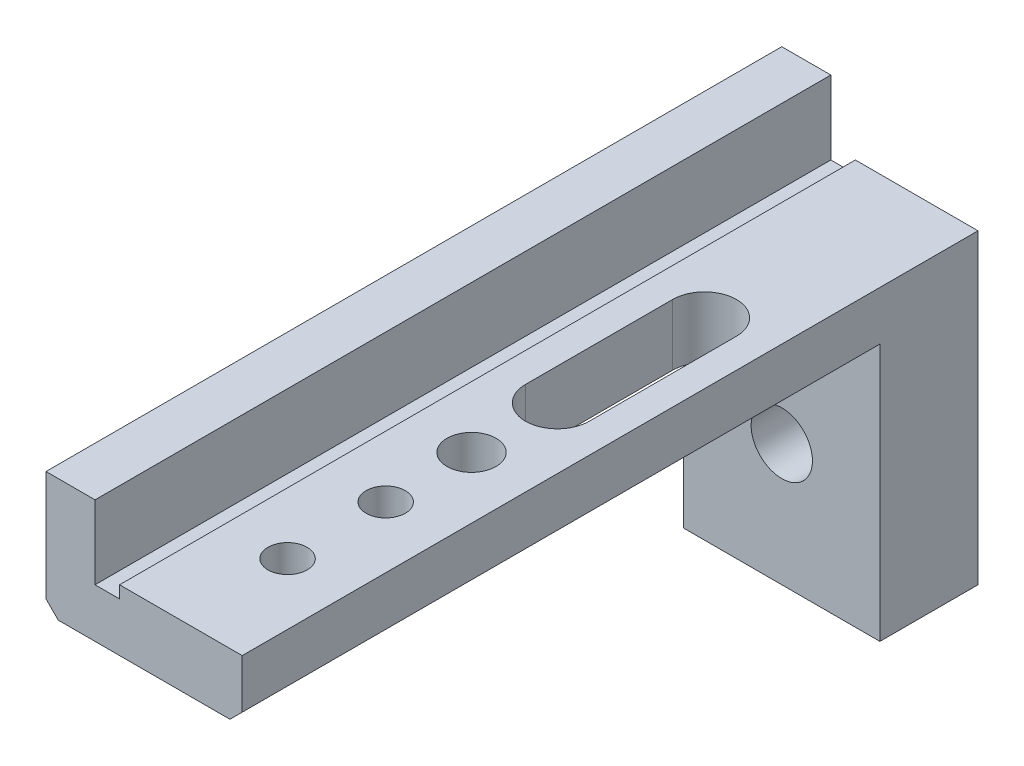
ISO-10303-21;
HEADER;
FILE_DESCRIPTION(('STEP AP214'),'2;1');
FILE_NAME('part.step','',(''),(''),'','','');
FILE_SCHEMA(('AUTOMOTIVE_DESIGN { 1 0 10303 214 1 1 1 1 }'));
ENDSEC;
DATA;
#1=APPLICATION_CONTEXT('core data for automotive mechanical design processes');
#2=APPLICATION_PROTOCOL_DEFINITION('international standard','automotive_design',2000,#1);
#3=PRODUCT_CONTEXT('',#1,'mechanical');
#4=PRODUCT('Part','Part','',(#3));
#5=PRODUCT_RELATED_PRODUCT_CATEGORY('part','',(#4));
#6=PRODUCT_DEFINITION_FORMATION('','',#4);
#7=PRODUCT_DEFINITION_CONTEXT('part definition',#1,'design');
#8=PRODUCT_DEFINITION('design','',#6,#7);
#9=PRODUCT_DEFINITION_SHAPE('','',#8);
#10=(LENGTH_UNIT() NAMED_UNIT(*) SI_UNIT(.MILLI.,.METRE.));
#11=(NAMED_UNIT(*) PLANE_ANGLE_UNIT() SI_UNIT($,.RADIAN.));
#12=(NAMED_UNIT(*) SI_UNIT($,.STERADIAN.) SOLID_ANGLE_UNIT());
#13=UNCERTAINTY_MEASURE_WITH_UNIT(LENGTH_MEASURE(1.E-05),#10,'distance_accuracy_value','');
#14=(GEOMETRIC_REPRESENTATION_CONTEXT(3) GLOBAL_UNCERTAINTY_ASSIGNED_CONTEXT((#13)) GLOBAL_UNIT_ASSIGNED_CONTEXT((#10,
#11,#12)) REPRESENTATION_CONTEXT('',''));
#15=CARTESIAN_POINT('',(0.,0.,0.));
#16=DIRECTION('',(0.,0.,1.));
#17=DIRECTION('',(1.,0.,0.));
#18=AXIS2_PLACEMENT_3D('',#15,#16,#17);
#19=CARTESIAN_POINT('',(-5.15254237288136,-1.99999999999999,30.));
#20=DIRECTION('',(0.,1.,0.));
#21=DIRECTION('',(0.,0.,1.));
#22=AXIS2_PLACEMENT_3D('',#19,#20,#21);
#23=PLANE('',#22);
#24=CARTESIAN_POINT('',(0.347457627118638,-1.99999999999999,21.65));
#25=DIRECTION('',(0.,1.,0.));
#26=DIRECTION('',(0.,0.,1.));
#27=AXIS2_PLACEMENT_3D('',#24,#25,#26);
#28=CIRCLE('',#27,0.799999999999997);
#29=CARTESIAN_POINT('',(0.347457627118638,-1.99999999999999,22.45));
#30=VERTEX_POINT('',#29);
#31=EDGE_CURVE('E402',#30,#30,#28,.T.);
#32=ORIENTED_EDGE('',*,*,#31,.T.);
#33=EDGE_LOOP('',(#32));
#34=FACE_BOUND('',#33,.T.);
#35=CARTESIAN_POINT('',(0.347457627118638,-1.99999999999999,25.65));
#36=DIRECTION('',(0.,1.,0.));
#37=DIRECTION('',(0.,0.,1.));
#38=AXIS2_PLACEMENT_3D('',#35,#36,#37);
#39=CIRCLE('',#38,0.799999999999997);
#40=CARTESIAN_POINT('',(0.347457627118638,-1.99999999999999,26.45));
#41=VERTEX_POINT('',#40);
#42=EDGE_CURVE('E401',#41,#41,#39,.T.);
#43=ORIENTED_EDGE('',*,*,#42,.T.);
#44=EDGE_LOOP('',(#43));
#45=FACE_BOUND('',#44,.T.);
#46=DIRECTION('',(0.,0.,1.));
#47=VECTOR('',#46,1.);
#48=CARTESIAN_POINT('',(-0.952542372881362,-1.99999999999999,30.));
#49=LINE('',#48,#47);
#50=CARTESIAN_POINT('',(-0.952542372881362,-1.99999999999999,8.65));
#51=VERTEX_POINT('',#50);
#52=CARTESIAN_POINT('',(-0.952542372881362,-1.99999999999999,14.65));
#53=VERTEX_POINT('',#52);
#54=EDGE_CURVE('E187',#51,#53,#49,.T.);
#55=ORIENTED_EDGE('',*,*,#54,.T.);
#56=CARTESIAN_POINT('',(0.347457627118638,-1.99999999999999,14.65));
#57=DIRECTION('',(0.,1.,0.));
#58=DIRECTION('',(0.,0.,1.));
#59=AXIS2_PLACEMENT_3D('',#56,#57,#58);
#60=CIRCLE('',#59,1.3);
#61=CARTESIAN_POINT('',(1.64745762711864,-1.99999999999999,14.65));
#62=VERTEX_POINT('',#61);
#63=EDGE_CURVE('E190',#53,#62,#60,.T.);
#64=ORIENTED_EDGE('',*,*,#63,.T.);
#65=DIRECTION('',(0.,0.,-1.));
#66=VECTOR('',#65,1.);
#67=CARTESIAN_POINT('',(1.64745762711864,-1.99999999999999,30.));
#68=LINE('',#67,#66);
#69=CARTESIAN_POINT('',(1.64745762711864,-1.99999999999999,8.65));
#70=VERTEX_POINT('',#69);
#71=EDGE_CURVE('E182',#62,#70,#68,.T.);
#72=ORIENTED_EDGE('',*,*,#71,.T.);
#73=CARTESIAN_POINT('',(0.347457627118638,-1.99999999999999,8.65));
#74=DIRECTION('',(0.,1.,0.));
#75=DIRECTION('',(0.,0.,1.));
#76=AXIS2_PLACEMENT_3D('',#73,#74,#75);
#77=CIRCLE('',#76,1.3);
#78=EDGE_CURVE('E157',#70,#51,#77,.T.);
#79=ORIENTED_EDGE('',*,*,#78,.T.);
#80=EDGE_LOOP('',(#55,#64,#72,#79));
#81=FACE_BOUND('',#80,.T.);
#82=CARTESIAN_POINT('',(0.347457627118638,-1.99999999999999,18.15));
#83=DIRECTION('',(0.,1.,0.));
#84=DIRECTION('',(0.,0.,1.));
#85=AXIS2_PLACEMENT_3D('',#82,#83,#84);
#86=CIRCLE('',#85,1.);
#87=CARTESIAN_POINT('',(0.347457627118638,-1.99999999999999,19.15));
#88=VERTEX_POINT('',#87);
#89=EDGE_CURVE('E196',#88,#88,#86,.T.);
#90=ORIENTED_EDGE('',*,*,#89,.T.);
#91=EDGE_LOOP('',(#90));
#92=FACE_BOUND('',#91,.T.);
#93=DIRECTION('',(1.,0.,0.));
#94=VECTOR('',#93,1.);
#95=CARTESIAN_POINT('',(-5.15254237288136,-1.99999999999999,30.));
#96=LINE('',#95,#94);
#97=CARTESIAN_POINT('',(-4.65254237288136,-1.99999999999999,30.));
#98=VERTEX_POINT('',#97);
#99=CARTESIAN_POINT('',(2.34745762711864,-1.99999999999999,30.));
#100=VERTEX_POINT('',#99);
#101=EDGE_CURVE('E219',#98,#100,#96,.T.);
#102=ORIENTED_EDGE('',*,*,#101,.F.);
#103=DIRECTION('',(0.,0.,-1.));
#104=VECTOR('',#103,1.);
#105=CARTESIAN_POINT('',(-4.65254237288136,-1.99999999999999,30.));
#106=LINE('',#105,#104);
#107=CARTESIAN_POINT('',(-4.65254237288136,-1.99999999999999,4.));
#108=VERTEX_POINT('',#107);
#109=EDGE_CURVE('E271',#98,#108,#106,.T.);
#110=ORIENTED_EDGE('',*,*,#109,.T.);
#111=DIRECTION('',(-1.,0.,0.));
#112=VECTOR('',#111,1.);
#113=CARTESIAN_POINT('',(-5.15254237288136,-1.99999999999999,4.));
#114=LINE('',#113,#112);
#115=CARTESIAN_POINT('',(2.34745762711864,-1.99999999999999,4.));
#116=VERTEX_POINT('',#115);
#117=EDGE_CURVE('E199',#116,#108,#114,.T.);
#118=ORIENTED_EDGE('',*,*,#117,.F.);
#119=DIRECTION('',(0.,0.,1.));
#120=VECTOR('',#119,1.);
#121=CARTESIAN_POINT('',(2.34745762711864,-1.99999999999999,30.));
#122=LINE('',#121,#120);
#123=EDGE_CURVE('E264',#116,#100,#122,.T.);
#124=ORIENTED_EDGE('',*,*,#123,.T.);
#125=EDGE_LOOP('',(#102,#110,#118,#124));
#126=FACE_BOUND('',#125,.T.);
#127=ADVANCED_FACE('F35',(#34,#45,#81,#92,#126),#23,.F.);
#128=CARTESIAN_POINT('',(-5.15254237288136,3.00000000000001,30.));
#129=DIRECTION('',(1.,0.,0.));
#130=DIRECTION('',(0.,1.,0.));
#131=AXIS2_PLACEMENT_3D('',#128,#129,#130);
#132=PLANE('',#131);
#133=DIRECTION('',(0.,1.,0.));
#134=VECTOR('',#133,1.);
#135=CARTESIAN_POINT('',(-5.15254237288136,-12.,4.));
#136=LINE('',#135,#134);
#137=CARTESIAN_POINT('',(-5.15254237288136,-12.,4.));
#138=VERTEX_POINT('',#137);
#139=CARTESIAN_POINT('',(-5.15254237288136,-1.49999999999999,4.));
#140=VERTEX_POINT('',#139);
#141=EDGE_CURVE('E210',#138,#140,#136,.T.);
#142=ORIENTED_EDGE('',*,*,#141,.T.);
#143=DIRECTION('',(0.,0.,1.));
#144=VECTOR('',#143,1.);
#145=CARTESIAN_POINT('',(-5.15254237288136,-1.49999999999999,30.));
#146=LINE('',#145,#144);
#147=CARTESIAN_POINT('',(-5.15254237288136,-1.49999999999999,30.));
#148=VERTEX_POINT('',#147);
#149=EDGE_CURVE('E274',#140,#148,#146,.T.);
#150=ORIENTED_EDGE('',*,*,#149,.T.);
#151=DIRECTION('',(0.,-1.,0.));
#152=VECTOR('',#151,1.);
#153=CARTESIAN_POINT('',(-5.15254237288136,3.00000000000001,30.));
#154=LINE('',#153,#152);
#155=CARTESIAN_POINT('',(-5.15254237288136,3.00000000000001,30.));
#156=VERTEX_POINT('',#155);
#157=EDGE_CURVE('E216',#156,#148,#154,.T.);
#158=ORIENTED_EDGE('',*,*,#157,.F.);
#159=DIRECTION('',(0.,0.,-1.));
#160=VECTOR('',#159,1.);
#161=CARTESIAN_POINT('',(-5.15254237288136,3.00000000000001,30.));
#162=LINE('',#161,#160);
#163=CARTESIAN_POINT('',(-5.15254237288136,3.00000000000001,0.));
#164=VERTEX_POINT('',#163);
#165=EDGE_CURVE('E234',#156,#164,#162,.T.);
#166=ORIENTED_EDGE('',*,*,#165,.T.);
#167=DIRECTION('',(0.,-1.,0.));
#168=VECTOR('',#167,1.);
#169=CARTESIAN_POINT('',(-5.15254237288136,3.00000000000001,0.));
#170=LINE('',#169,#168);
#171=CARTESIAN_POINT('',(-5.15254237288136,-12.,0.));
#172=VERTEX_POINT('',#171);
#173=EDGE_CURVE('E215',#164,#172,#170,.T.);
#174=ORIENTED_EDGE('',*,*,#173,.T.);
#175=DIRECTION('',(0.,0.,-1.));
#176=VECTOR('',#175,1.);
#177=CARTESIAN_POINT('',(-5.15254237288136,-12.,0.));
#178=LINE('',#177,#176);
#179=EDGE_CURVE('E200',#138,#172,#178,.T.);
#180=ORIENTED_EDGE('',*,*,#179,.F.);
#181=EDGE_LOOP('',(#142,#150,#158,#166,#174,#180));
#182=FACE_BOUND('',#181,.T.);
#183=ADVANCED_FACE('F293',(#182),#132,.F.);
#184=CARTESIAN_POINT('',(2.84745762711864,-1.99999999999999,30.));
#185=DIRECTION('',(-1.,0.,0.));
#186=DIRECTION('',(0.,-1.,0.));
#187=AXIS2_PLACEMENT_3D('',#184,#185,#186);
#188=PLANE('',#187);
#189=DIRECTION('',(0.,1.,0.));
#190=VECTOR('',#189,1.);
#191=CARTESIAN_POINT('',(2.84745762711864,-1.99999999999999,30.));
#192=LINE('',#191,#190);
#193=CARTESIAN_POINT('',(2.84745762711864,-1.5,30.));
#194=VERTEX_POINT('',#193);
#195=CARTESIAN_POINT('',(2.84745762711864,0.500000000000006,30.));
#196=VERTEX_POINT('',#195);
#197=EDGE_CURVE('E222',#194,#196,#192,.T.);
#198=ORIENTED_EDGE('',*,*,#197,.F.);
#199=DIRECTION('',(0.,0.,-1.));
#200=VECTOR('',#199,1.);
#201=CARTESIAN_POINT('',(2.84745762711864,-1.5,30.));
#202=LINE('',#201,#200);
#203=CARTESIAN_POINT('',(2.84745762711864,-1.5,4.));
#204=VERTEX_POINT('',#203);
#205=EDGE_CURVE('E279',#194,#204,#202,.T.);
#206=ORIENTED_EDGE('',*,*,#205,.T.);
#207=DIRECTION('',(0.,1.,0.));
#208=VECTOR('',#207,1.);
#209=CARTESIAN_POINT('',(2.84745762711864,-12.,4.));
#210=LINE('',#209,#208);
#211=CARTESIAN_POINT('',(2.84745762711864,-12.,4.));
#212=VERTEX_POINT('',#211);
#213=EDGE_CURVE('E49',#212,#204,#210,.T.);
#214=ORIENTED_EDGE('',*,*,#213,.F.);
#215=DIRECTION('',(0.,0.,1.));
#216=VECTOR('',#215,1.);
#217=CARTESIAN_POINT('',(2.84745762711864,-12.,0.));
#218=LINE('',#217,#216);
#219=CARTESIAN_POINT('',(2.84745762711864,-12.,0.));
#220=VERTEX_POINT('',#219);
#221=EDGE_CURVE('E206',#220,#212,#218,.T.);
#222=ORIENTED_EDGE('',*,*,#221,.F.);
#223=DIRECTION('',(0.,1.,0.));
#224=VECTOR('',#223,1.);
#225=CARTESIAN_POINT('',(2.84745762711864,-1.99999999999999,0.));
#226=LINE('',#225,#224);
#227=CARTESIAN_POINT('',(2.84745762711864,0.500000000000006,0.));
#228=VERTEX_POINT('',#227);
#229=EDGE_CURVE('E236',#220,#228,#226,.T.);
#230=ORIENTED_EDGE('',*,*,#229,.T.);
#231=DIRECTION('',(0.,0.,-1.));
#232=VECTOR('',#231,1.);
#233=CARTESIAN_POINT('',(2.84745762711864,0.500000000000006,30.));
#234=LINE('',#233,#232);
#235=EDGE_CURVE('E261',#196,#228,#234,.T.);
#236=ORIENTED_EDGE('',*,*,#235,.F.);
#237=EDGE_LOOP('',(#198,#206,#214,#222,#230,#236));
#238=FACE_BOUND('',#237,.T.);
#239=ADVANCED_FACE('F313',(#238),#188,.F.);
#240=CARTESIAN_POINT('',(-2.15254237288136,0.500000000000005,30.));
#241=DIRECTION('',(0.,-1.,0.));
#242=DIRECTION('',(1.,0.,0.));
#243=AXIS2_PLACEMENT_3D('',#240,#241,#242);
#244=PLANE('',#243);
#245=CARTESIAN_POINT('',(0.347457627118638,0.500000000000006,21.65));
#246=DIRECTION('',(0.,1.,0.));
#247=DIRECTION('',(0.,0.,1.));
#248=AXIS2_PLACEMENT_3D('',#245,#246,#247);
#249=CIRCLE('',#248,0.799999999999998);
#250=CARTESIAN_POINT('',(0.347457627118638,0.500000000000006,22.45));
#251=VERTEX_POINT('',#250);
#252=EDGE_CURVE('E268',#251,#251,#249,.T.);
#253=ORIENTED_EDGE('',*,*,#252,.F.);
#254=EDGE_LOOP('',(#253));
#255=FACE_BOUND('',#254,.T.);
#256=CARTESIAN_POINT('',(0.347457627118638,0.500000000000006,25.65));
#257=DIRECTION('',(0.,1.,0.));
#258=DIRECTION('',(0.,0.,1.));
#259=AXIS2_PLACEMENT_3D('',#256,#257,#258);
#260=CIRCLE('',#259,0.799999999999998);
#261=CARTESIAN_POINT('',(0.347457627118638,0.500000000000006,26.45));
#262=VERTEX_POINT('',#261);
#263=EDGE_CURVE('E400',#262,#262,#260,.T.);
#264=ORIENTED_EDGE('',*,*,#263,.F.);
#265=EDGE_LOOP('',(#264));
#266=FACE_BOUND('',#265,.T.);
#267=DIRECTION('',(0.,0.,-1.));
#268=VECTOR('',#267,1.);
#269=CARTESIAN_POINT('',(1.64745762711864,0.500000000000006,14.65));
#270=LINE('',#269,#268);
#271=CARTESIAN_POINT('',(1.64745762711864,0.500000000000006,14.65));
#272=VERTEX_POINT('',#271);
#273=CARTESIAN_POINT('',(1.64745762711864,0.500000000000006,8.65));
#274=VERTEX_POINT('',#273);
#275=EDGE_CURVE('E165',#272,#274,#270,.T.);
#276=ORIENTED_EDGE('',*,*,#275,.F.);
#277=CARTESIAN_POINT('',(0.347457627118638,0.500000000000006,14.65));
#278=DIRECTION('',(0.,1.,0.));
#279=DIRECTION('',(-1.,0.,0.));
#280=AXIS2_PLACEMENT_3D('',#277,#278,#279);
#281=CIRCLE('',#280,1.3);
#282=CARTESIAN_POINT('',(-0.952542372881362,0.500000000000005,14.65));
#283=VERTEX_POINT('',#282);
#284=EDGE_CURVE('E170',#283,#272,#281,.T.);
#285=ORIENTED_EDGE('',*,*,#284,.F.);
#286=DIRECTION('',(0.,0.,1.));
#287=VECTOR('',#286,1.);
#288=CARTESIAN_POINT('',(-0.952542372881362,0.500000000000005,14.65));
#289=LINE('',#288,#287);
#290=CARTESIAN_POINT('',(-0.952542372881362,0.500000000000005,8.65));
#291=VERTEX_POINT('',#290);
#292=EDGE_CURVE('E175',#291,#283,#289,.T.);
#293=ORIENTED_EDGE('',*,*,#292,.F.);
#294=CARTESIAN_POINT('',(0.347457627118638,0.500000000000006,8.65));
#295=DIRECTION('',(0.,1.,0.));
#296=DIRECTION('',(-1.,0.,0.));
#297=AXIS2_PLACEMENT_3D('',#294,#295,#296);
#298=CIRCLE('',#297,1.3);
#299=EDGE_CURVE('E154',#274,#291,#298,.T.);
#300=ORIENTED_EDGE('',*,*,#299,.F.);
#301=EDGE_LOOP('',(#276,#285,#293,#300));
#302=FACE_BOUND('',#301,.T.);
#303=CARTESIAN_POINT('',(0.347457627118638,0.500000000000006,18.15));
#304=DIRECTION('',(0.,1.,0.));
#305=DIRECTION('',(-1.,0.,0.));
#306=AXIS2_PLACEMENT_3D('',#303,#304,#305);
#307=CIRCLE('',#306,1.);
#308=CARTESIAN_POINT('',(-0.652542372881363,0.500000000000005,18.15));
#309=VERTEX_POINT('',#308);
#310=EDGE_CURVE('E193',#309,#309,#307,.T.);
#311=ORIENTED_EDGE('',*,*,#310,.F.);
#312=EDGE_LOOP('',(#311));
#313=FACE_BOUND('',#312,.T.);
#314=DIRECTION('',(-1.,0.,0.));
#315=VECTOR('',#314,1.);
#316=CARTESIAN_POINT('',(-2.15254237288136,0.500000000000005,0.));
#317=LINE('',#316,#315);
#318=CARTESIAN_POINT('',(-2.15254237288136,0.500000000000005,0.));
#319=VERTEX_POINT('',#318);
#320=EDGE_CURVE('E238',#228,#319,#317,.T.);
#321=ORIENTED_EDGE('',*,*,#320,.T.);
#322=DIRECTION('',(0.,0.,-1.));
#323=VECTOR('',#322,1.);
#324=CARTESIAN_POINT('',(-2.15254237288136,0.500000000000005,30.));
#325=LINE('',#324,#323);
#326=CARTESIAN_POINT('',(-2.15254237288136,0.500000000000005,30.));
#327=VERTEX_POINT('',#326);
#328=EDGE_CURVE('E258',#327,#319,#325,.T.);
#329=ORIENTED_EDGE('',*,*,#328,.F.);
#330=DIRECTION('',(-1.,0.,0.));
#331=VECTOR('',#330,1.);
#332=CARTESIAN_POINT('',(-2.15254237288136,0.500000000000005,30.));
#333=LINE('',#332,#331);
#334=EDGE_CURVE('E224',#196,#327,#333,.T.);
#335=ORIENTED_EDGE('',*,*,#334,.F.);
#336=ORIENTED_EDGE('',*,*,#235,.T.);
#337=EDGE_LOOP('',(#321,#329,#335,#336));
#338=FACE_BOUND('',#337,.T.);
#339=ADVANCED_FACE('F172',(#255,#266,#302,#313,#338),#244,.F.);
#340=CARTESIAN_POINT('',(-2.15254237288136,0.,30.));
#341=DIRECTION('',(1.,0.,0.));
#342=DIRECTION('',(0.,0.,-1.));
#343=AXIS2_PLACEMENT_3D('',#340,#341,#342);
#344=PLANE('',#343);
#345=DIRECTION('',(0.,-1.,0.));
#346=VECTOR('',#345,1.);
#347=CARTESIAN_POINT('',(-2.15254237288136,0.,0.));
#348=LINE('',#347,#346);
#349=CARTESIAN_POINT('',(-2.15254237288136,0.,0.));
#350=VERTEX_POINT('',#349);
#351=EDGE_CURVE('E240',#319,#350,#348,.T.);
#352=ORIENTED_EDGE('',*,*,#351,.T.);
#353=DIRECTION('',(0.,0.,-1.));
#354=VECTOR('',#353,1.);
#355=CARTESIAN_POINT('',(-2.15254237288136,0.,30.));
#356=LINE('',#355,#354);
#357=CARTESIAN_POINT('',(-2.15254237288136,0.,30.));
#358=VERTEX_POINT('',#357);
#359=EDGE_CURVE('E255',#358,#350,#356,.T.);
#360=ORIENTED_EDGE('',*,*,#359,.F.);
#361=DIRECTION('',(0.,-1.,0.));
#362=VECTOR('',#361,1.);
#363=CARTESIAN_POINT('',(-2.15254237288136,0.,30.));
#364=LINE('',#363,#362);
#365=EDGE_CURVE('E226',#327,#358,#364,.T.);
#366=ORIENTED_EDGE('',*,*,#365,.F.);
#367=ORIENTED_EDGE('',*,*,#328,.T.);
#368=EDGE_LOOP('',(#352,#360,#366,#367));
#369=FACE_BOUND('',#368,.T.);
#370=ADVANCED_FACE('F386',(#369),#344,.F.);
#371=CARTESIAN_POINT('',(-3.15254237288136,0.,30.));
#372=DIRECTION('',(0.,-1.,0.));
#373=DIRECTION('',(0.,0.,-1.));
#374=AXIS2_PLACEMENT_3D('',#371,#372,#373);
#375=PLANE('',#374);
#376=DIRECTION('',(-1.,0.,0.));
#377=VECTOR('',#376,1.);
#378=CARTESIAN_POINT('',(-3.15254237288136,0.,0.));
#379=LINE('',#378,#377);
#380=CARTESIAN_POINT('',(-3.15254237288136,0.,0.));
#381=VERTEX_POINT('',#380);
#382=EDGE_CURVE('E242',#350,#381,#379,.T.);
#383=ORIENTED_EDGE('',*,*,#382,.T.);
#384=DIRECTION('',(0.,0.,-1.));
#385=VECTOR('',#384,1.);
#386=CARTESIAN_POINT('',(-3.15254237288136,0.,30.));
#387=LINE('',#386,#385);
#388=CARTESIAN_POINT('',(-3.15254237288136,0.,30.));
#389=VERTEX_POINT('',#388);
#390=EDGE_CURVE('E252',#389,#381,#387,.T.);
#391=ORIENTED_EDGE('',*,*,#390,.F.);
#392=DIRECTION('',(-1.,0.,0.));
#393=VECTOR('',#392,1.);
#394=CARTESIAN_POINT('',(-3.15254237288136,0.,30.));
#395=LINE('',#394,#393);
#396=EDGE_CURVE('E228',#358,#389,#395,.T.);
#397=ORIENTED_EDGE('',*,*,#396,.F.);
#398=ORIENTED_EDGE('',*,*,#359,.T.);
#399=EDGE_LOOP('',(#383,#391,#397,#398));
#400=FACE_BOUND('',#399,.T.);
#401=ADVANCED_FACE('F382',(#400),#375,.F.);
#402=CARTESIAN_POINT('',(-3.15254237288136,3.00000000000001,30.));
#403=DIRECTION('',(-1.,0.,0.));
#404=DIRECTION('',(0.,-1.,0.));
#405=AXIS2_PLACEMENT_3D('',#402,#403,#404);
#406=PLANE('',#405);
#407=DIRECTION('',(0.,1.,0.));
#408=VECTOR('',#407,1.);
#409=CARTESIAN_POINT('',(-3.15254237288136,3.00000000000001,0.));
#410=LINE('',#409,#408);
#411=CARTESIAN_POINT('',(-3.15254237288136,3.00000000000001,0.));
#412=VERTEX_POINT('',#411);
#413=EDGE_CURVE('E244',#381,#412,#410,.T.);
#414=ORIENTED_EDGE('',*,*,#413,.T.);
#415=DIRECTION('',(0.,0.,-1.));
#416=VECTOR('',#415,1.);
#417=CARTESIAN_POINT('',(-3.15254237288136,3.00000000000001,30.));
#418=LINE('',#417,#416);
#419=CARTESIAN_POINT('',(-3.15254237288136,3.00000000000001,30.));
#420=VERTEX_POINT('',#419);
#421=EDGE_CURVE('E249',#420,#412,#418,.T.);
#422=ORIENTED_EDGE('',*,*,#421,.F.);
#423=DIRECTION('',(0.,1.,0.));
#424=VECTOR('',#423,1.);
#425=CARTESIAN_POINT('',(-3.15254237288136,3.00000000000001,30.));
#426=LINE('',#425,#424);
#427=EDGE_CURVE('E230',#389,#420,#426,.T.);
#428=ORIENTED_EDGE('',*,*,#427,.F.);
#429=ORIENTED_EDGE('',*,*,#390,.T.);
#430=EDGE_LOOP('',(#414,#422,#428,#429));
#431=FACE_BOUND('',#430,.T.);
#432=ADVANCED_FACE('F379',(#431),#406,.F.);
#433=CARTESIAN_POINT('',(-5.15254237288136,3.00000000000001,30.));
#434=DIRECTION('',(0.,-1.,0.));
#435=DIRECTION('',(0.,0.,-1.));
#436=AXIS2_PLACEMENT_3D('',#433,#434,#435);
#437=PLANE('',#436);
#438=DIRECTION('',(-1.,0.,0.));
#439=VECTOR('',#438,1.);
#440=CARTESIAN_POINT('',(-5.15254237288136,3.00000000000001,0.));
#441=LINE('',#440,#439);
#442=EDGE_CURVE('E220',#412,#164,#441,.T.);
#443=ORIENTED_EDGE('',*,*,#442,.T.);
#444=ORIENTED_EDGE('',*,*,#165,.F.);
#445=DIRECTION('',(-1.,0.,0.));
#446=VECTOR('',#445,1.);
#447=CARTESIAN_POINT('',(-5.15254237288136,3.00000000000001,30.));
#448=LINE('',#447,#446);
#449=EDGE_CURVE('E232',#420,#156,#448,.T.);
#450=ORIENTED_EDGE('',*,*,#449,.F.);
#451=ORIENTED_EDGE('',*,*,#421,.T.);
#452=EDGE_LOOP('',(#443,#444,#450,#451));
#453=FACE_BOUND('',#452,.T.);
#454=ADVANCED_FACE('F301',(#453),#437,.F.);
#455=CARTESIAN_POINT('',(0.,0.,30.));
#456=DIRECTION('',(0.,0.,1.));
#457=DIRECTION('',(1.,0.,0.));
#458=AXIS2_PLACEMENT_3D('',#455,#456,#457);
#459=PLANE('',#458);
#460=ORIENTED_EDGE('',*,*,#157,.T.);
#461=DIRECTION('',(-0.707106781186545,0.70710678118655,0.));
#462=VECTOR('',#461,1.);
#463=CARTESIAN_POINT('',(-3.3262711864407,-3.32627118644067,30.));
#464=LINE('',#463,#462);
#465=EDGE_CURVE('E277',#148,#98,#464,.F.);
#466=ORIENTED_EDGE('',*,*,#465,.T.);
#467=ORIENTED_EDGE('',*,*,#101,.T.);
#468=DIRECTION('',(-0.70710678118655,-0.707106781186545,0.));
#469=VECTOR('',#468,1.);
#470=CARTESIAN_POINT('',(2.17372881355931,-2.17372881355932,30.));
#471=LINE('',#470,#469);
#472=EDGE_CURVE('E57',#100,#194,#471,.F.);
#473=ORIENTED_EDGE('',*,*,#472,.T.);
#474=ORIENTED_EDGE('',*,*,#197,.T.);
#475=ORIENTED_EDGE('',*,*,#334,.T.);
#476=ORIENTED_EDGE('',*,*,#365,.T.);
#477=ORIENTED_EDGE('',*,*,#396,.T.);
#478=ORIENTED_EDGE('',*,*,#427,.T.);
#479=ORIENTED_EDGE('',*,*,#449,.T.);
#480=EDGE_LOOP('',(#460,#466,#467,#473,#474,#475,#476,#477,#478,#479));
#481=FACE_BOUND('',#480,.T.);
#482=ADVANCED_FACE('F294',(#481),#459,.T.);
#483=CARTESIAN_POINT('',(0.,0.,0.));
#484=DIRECTION('',(0.,0.,1.));
#485=DIRECTION('',(1.,0.,0.));
#486=AXIS2_PLACEMENT_3D('',#483,#484,#485);
#487=PLANE('',#486);
#488=CARTESIAN_POINT('',(-1.15254237288136,-6.99999999999999,0.));
#489=DIRECTION('',(0.,0.,1.));
#490=DIRECTION('',(1.,0.,0.));
#491=AXIS2_PLACEMENT_3D('',#488,#489,#490);
#492=CIRCLE('',#491,1.25);
#493=CARTESIAN_POINT('',(0.0974576271186374,-6.99999999999999,0.));
#494=VERTEX_POINT('',#493);
#495=EDGE_CURVE('E265',#494,#494,#492,.T.);
#496=ORIENTED_EDGE('',*,*,#495,.T.);
#497=EDGE_LOOP('',(#496));
#498=FACE_BOUND('',#497,.T.);
#499=ORIENTED_EDGE('',*,*,#173,.F.);
#500=ORIENTED_EDGE('',*,*,#442,.F.);
#501=ORIENTED_EDGE('',*,*,#413,.F.);
#502=ORIENTED_EDGE('',*,*,#382,.F.);
#503=ORIENTED_EDGE('',*,*,#351,.F.);
#504=ORIENTED_EDGE('',*,*,#320,.F.);
#505=ORIENTED_EDGE('',*,*,#229,.F.);
#506=DIRECTION('',(1.,0.,0.));
#507=VECTOR('',#506,1.);
#508=CARTESIAN_POINT('',(-5.15254237288136,-12.,0.));
#509=LINE('',#508,#507);
#510=EDGE_CURVE('E203',#172,#220,#509,.T.);
#511=ORIENTED_EDGE('',*,*,#510,.F.);
#512=EDGE_LOOP('',(#499,#500,#501,#502,#503,#504,#505,#511));
#513=FACE_BOUND('',#512,.T.);
#514=ADVANCED_FACE('F306',(#498,#513),#487,.F.);
#515=CARTESIAN_POINT('',(-5.15254237288136,-12.,4.));
#516=DIRECTION('',(0.,0.,-1.));
#517=DIRECTION('',(-1.,0.,0.));
#518=AXIS2_PLACEMENT_3D('',#515,#516,#517);
#519=PLANE('',#518);
#520=CARTESIAN_POINT('',(-1.15254237288136,-6.99999999999999,4.));
#521=DIRECTION('',(0.,0.,1.));
#522=DIRECTION('',(1.,0.,0.));
#523=AXIS2_PLACEMENT_3D('',#520,#521,#522);
#524=CIRCLE('',#523,1.25);
#525=CARTESIAN_POINT('',(0.0974576271186378,-6.99999999999999,4.));
#526=VERTEX_POINT('',#525);
#527=EDGE_CURVE('E269',#526,#526,#524,.T.);
#528=ORIENTED_EDGE('',*,*,#527,.F.);
#529=EDGE_LOOP('',(#528));
#530=FACE_BOUND('',#529,.T.);
#531=ORIENTED_EDGE('',*,*,#213,.T.);
#532=DIRECTION('',(0.70710678118655,0.707106781186545,0.));
#533=VECTOR('',#532,1.);
#534=CARTESIAN_POINT('',(-6.40254237288139,-10.75,4.));
#535=LINE('',#534,#533);
#536=EDGE_CURVE('E11',#204,#116,#535,.F.);
#537=ORIENTED_EDGE('',*,*,#536,.T.);
#538=ORIENTED_EDGE('',*,*,#117,.T.);
#539=DIRECTION('',(0.707106781186545,-0.70710678118655,0.));
#540=VECTOR('',#539,1.);
#541=CARTESIAN_POINT('',(0.0974576271186378,-6.75000000000003,4.));
#542=LINE('',#541,#540);
#543=EDGE_CURVE('E43',#108,#140,#542,.F.);
#544=ORIENTED_EDGE('',*,*,#543,.T.);
#545=ORIENTED_EDGE('',*,*,#141,.F.);
#546=DIRECTION('',(-1.,0.,0.));
#547=VECTOR('',#546,1.);
#548=CARTESIAN_POINT('',(-5.15254237288136,-12.,4.));
#549=LINE('',#548,#547);
#550=EDGE_CURVE('E208',#212,#138,#549,.T.);
#551=ORIENTED_EDGE('',*,*,#550,.F.);
#552=EDGE_LOOP('',(#531,#537,#538,#544,#545,#551));
#553=FACE_BOUND('',#552,.T.);
#554=ADVANCED_FACE('F284',(#530,#553),#519,.F.);
#555=CARTESIAN_POINT('',(0.,-12.,0.));
#556=DIRECTION('',(0.,1.,0.));
#557=DIRECTION('',(0.,0.,1.));
#558=AXIS2_PLACEMENT_3D('',#555,#556,#557);
#559=PLANE('',#558);
#560=ORIENTED_EDGE('',*,*,#179,.T.);
#561=ORIENTED_EDGE('',*,*,#510,.T.);
#562=ORIENTED_EDGE('',*,*,#221,.T.);
#563=ORIENTED_EDGE('',*,*,#550,.T.);
#564=EDGE_LOOP('',(#560,#561,#562,#563));
#565=FACE_BOUND('',#564,.T.);
#566=ADVANCED_FACE('F311',(#565),#559,.F.);
#567=CARTESIAN_POINT('',(0.34745762711864,-9.49999999999999,18.15));
#568=DIRECTION('',(0.,1.,0.));
#569=DIRECTION('',(-1.,0.,0.));
#570=AXIS2_PLACEMENT_3D('',#567,#568,#569);
#571=CYLINDRICAL_SURFACE('',#570,1.);
#572=ORIENTED_EDGE('',*,*,#310,.T.);
#573=EDGE_LOOP('',(#572));
#574=FACE_BOUND('',#573,.T.);
#575=ORIENTED_EDGE('',*,*,#89,.F.);
#576=EDGE_LOOP('',(#575));
#577=FACE_BOUND('',#576,.T.);
#578=ADVANCED_FACE('F362',(#574,#577),#571,.F.);
#579=CARTESIAN_POINT('',(0.34745762711864,-9.49999999999999,14.65));
#580=DIRECTION('',(0.,1.,0.));
#581=DIRECTION('',(-1.,0.,0.));
#582=AXIS2_PLACEMENT_3D('',#579,#580,#581);
#583=CYLINDRICAL_SURFACE('',#582,1.3);
#584=DIRECTION('',(0.,1.,0.));
#585=VECTOR('',#584,1.);
#586=CARTESIAN_POINT('',(-0.95254237288136,-9.49999999999999,14.65));
#587=LINE('',#586,#585);
#588=EDGE_CURVE('E180',#53,#283,#587,.T.);
#589=ORIENTED_EDGE('',*,*,#588,.T.);
#590=ORIENTED_EDGE('',*,*,#284,.T.);
#591=DIRECTION('',(0.,1.,0.));
#592=VECTOR('',#591,1.);
#593=CARTESIAN_POINT('',(1.64745762711864,-9.49999999999999,14.65));
#594=LINE('',#593,#592);
#595=EDGE_CURVE('E161',#62,#272,#594,.T.);
#596=ORIENTED_EDGE('',*,*,#595,.F.);
#597=ORIENTED_EDGE('',*,*,#63,.F.);
#598=EDGE_LOOP('',(#589,#590,#596,#597));
#599=FACE_BOUND('',#598,.T.);
#600=ADVANCED_FACE('F354',(#599),#583,.F.);
#601=CARTESIAN_POINT('',(-0.95254237288136,-9.49999999999999,14.65));
#602=DIRECTION('',(-1.,0.,0.));
#603=DIRECTION('',(0.,-1.,0.));
#604=AXIS2_PLACEMENT_3D('',#601,#602,#603);
#605=PLANE('',#604);
#606=DIRECTION('',(0.,1.,0.));
#607=VECTOR('',#606,1.);
#608=CARTESIAN_POINT('',(-0.95254237288136,-9.49999999999999,8.65));
#609=LINE('',#608,#607);
#610=EDGE_CURVE('E160',#51,#291,#609,.T.);
#611=ORIENTED_EDGE('',*,*,#610,.T.);
#612=ORIENTED_EDGE('',*,*,#292,.T.);
#613=ORIENTED_EDGE('',*,*,#588,.F.);
#614=ORIENTED_EDGE('',*,*,#54,.F.);
#615=EDGE_LOOP('',(#611,#612,#613,#614));
#616=FACE_BOUND('',#615,.T.);
#617=ADVANCED_FACE('F351',(#616),#605,.F.);
#618=CARTESIAN_POINT('',(0.34745762711864,-9.49999999999999,8.65));
#619=DIRECTION('',(0.,1.,0.));
#620=DIRECTION('',(-1.,0.,0.));
#621=AXIS2_PLACEMENT_3D('',#618,#619,#620);
#622=CYLINDRICAL_SURFACE('',#621,1.3);
#623=DIRECTION('',(0.,1.,0.));
#624=VECTOR('',#623,1.);
#625=CARTESIAN_POINT('',(1.64745762711864,-9.49999999999999,8.65));
#626=LINE('',#625,#624);
#627=EDGE_CURVE('E149',#70,#274,#626,.T.);
#628=ORIENTED_EDGE('',*,*,#627,.T.);
#629=ORIENTED_EDGE('',*,*,#299,.T.);
#630=ORIENTED_EDGE('',*,*,#610,.F.);
#631=ORIENTED_EDGE('',*,*,#78,.F.);
#632=EDGE_LOOP('',(#628,#629,#630,#631));
#633=FACE_BOUND('',#632,.T.);
#634=ADVANCED_FACE('F151',(#633),#622,.F.);
#635=CARTESIAN_POINT('',(1.64745762711864,-9.49999999999999,14.65));
#636=DIRECTION('',(1.,0.,0.));
#637=DIRECTION('',(0.,1.,0.));
#638=AXIS2_PLACEMENT_3D('',#635,#636,#637);
#639=PLANE('',#638);
#640=ORIENTED_EDGE('',*,*,#595,.T.);
#641=ORIENTED_EDGE('',*,*,#275,.T.);
#642=ORIENTED_EDGE('',*,*,#627,.F.);
#643=ORIENTED_EDGE('',*,*,#71,.F.);
#644=EDGE_LOOP('',(#640,#641,#642,#643));
#645=FACE_BOUND('',#644,.T.);
#646=ADVANCED_FACE('F166',(#645),#639,.F.);
#647=CARTESIAN_POINT('',(0.347457627118638,0.500000000000006,25.65));
#648=DIRECTION('',(0.,1.,0.));
#649=DIRECTION('',(0.,0.,1.));
#650=AXIS2_PLACEMENT_3D('',#647,#648,#649);
#651=CYLINDRICAL_SURFACE('',#650,0.799999999999997);
#652=ORIENTED_EDGE('',*,*,#263,.T.);
#653=EDGE_LOOP('',(#652));
#654=FACE_BOUND('',#653,.T.);
#655=ORIENTED_EDGE('',*,*,#42,.F.);
#656=EDGE_LOOP('',(#655));
#657=FACE_BOUND('',#656,.T.);
#658=ADVANCED_FACE('F342',(#654,#657),#651,.F.);
#659=CARTESIAN_POINT('',(0.347457627118638,0.500000000000006,21.65));
#660=DIRECTION('',(0.,1.,0.));
#661=DIRECTION('',(0.,0.,1.));
#662=AXIS2_PLACEMENT_3D('',#659,#660,#661);
#663=CYLINDRICAL_SURFACE('',#662,0.799999999999997);
#664=ORIENTED_EDGE('',*,*,#252,.T.);
#665=EDGE_LOOP('',(#664));
#666=FACE_BOUND('',#665,.T.);
#667=ORIENTED_EDGE('',*,*,#31,.F.);
#668=EDGE_LOOP('',(#667));
#669=FACE_BOUND('',#668,.T.);
#670=ADVANCED_FACE('F336',(#666,#669),#663,.F.);
#671=CARTESIAN_POINT('',(-1.15254237288136,-6.99999999999999,4.));
#672=DIRECTION('',(0.,0.,1.));
#673=DIRECTION('',(1.,0.,0.));
#674=AXIS2_PLACEMENT_3D('',#671,#672,#673);
#675=CYLINDRICAL_SURFACE('',#674,1.25);
#676=ORIENTED_EDGE('',*,*,#527,.T.);
#677=EDGE_LOOP('',(#676));
#678=FACE_BOUND('',#677,.T.);
#679=ORIENTED_EDGE('',*,*,#495,.F.);
#680=EDGE_LOOP('',(#679));
#681=FACE_BOUND('',#680,.T.);
#682=ADVANCED_FACE('F331',(#678,#681),#675,.F.);
#683=CARTESIAN_POINT('',(-4.65254237288136,-1.99999999999999,30.));
#684=DIRECTION('',(0.70710678118655,0.707106781186545,0.));
#685=DIRECTION('',(0.,0.,-1.));
#686=AXIS2_PLACEMENT_3D('',#683,#684,#685);
#687=PLANE('',#686);
#688=ORIENTED_EDGE('',*,*,#465,.F.);
#689=ORIENTED_EDGE('',*,*,#149,.F.);
#690=ORIENTED_EDGE('',*,*,#543,.F.);
#691=ORIENTED_EDGE('',*,*,#109,.F.);
#692=EDGE_LOOP('',(#688,#689,#690,#691));
#693=FACE_BOUND('',#692,.T.);
#694=ADVANCED_FACE('F290',(#693),#687,.F.);
#695=CARTESIAN_POINT('',(2.84745762711864,-1.5,30.));
#696=DIRECTION('',(-0.707106781186545,0.70710678118655,0.));
#697=DIRECTION('',(0.,0.,-1.));
#698=AXIS2_PLACEMENT_3D('',#695,#696,#697);
#699=PLANE('',#698);
#700=ORIENTED_EDGE('',*,*,#472,.F.);
#701=ORIENTED_EDGE('',*,*,#123,.F.);
#702=ORIENTED_EDGE('',*,*,#536,.F.);
#703=ORIENTED_EDGE('',*,*,#205,.F.);
#704=EDGE_LOOP('',(#700,#701,#702,#703));
#705=FACE_BOUND('',#704,.T.);
#706=ADVANCED_FACE('F37',(#705),#699,.F.);
#707=CLOSED_SHELL('',(#127,#183,#239,#339,#370,#401,#432,#454,#482,#514,#554,#566,#578,#600,
#617,#634,#646,#658,#670,#682,#694,#706));
#708=MANIFOLD_SOLID_BREP('B2',#707);
#709=ADVANCED_BREP_SHAPE_REPRESENTATION('',(#18,#708),#14);
#710=SHAPE_DEFINITION_REPRESENTATION(#9,#709);
ENDSEC;
END-ISO-10303-21;
